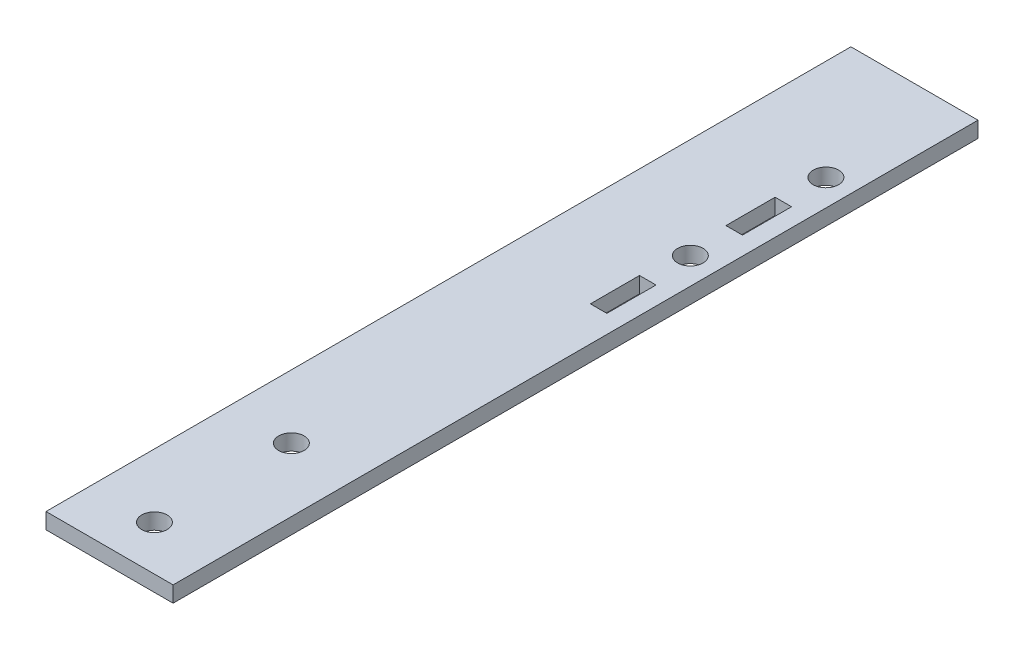
ISO-10303-21;
HEADER;
FILE_DESCRIPTION(('STEP AP214'),'2;1');
FILE_NAME('part.step','',(''),(''),'','','');
FILE_SCHEMA(('AUTOMOTIVE_DESIGN { 1 0 10303 214 1 1 1 1 }'));
ENDSEC;
DATA;
#1=APPLICATION_CONTEXT('core data for automotive mechanical design processes');
#2=APPLICATION_PROTOCOL_DEFINITION('international standard','automotive_design',2000,#1);
#3=PRODUCT_CONTEXT('',#1,'mechanical');
#4=PRODUCT('Part','Part','',(#3));
#5=PRODUCT_RELATED_PRODUCT_CATEGORY('part','',(#4));
#6=PRODUCT_DEFINITION_FORMATION('','',#4);
#7=PRODUCT_DEFINITION_CONTEXT('part definition',#1,'design');
#8=PRODUCT_DEFINITION('design','',#6,#7);
#9=PRODUCT_DEFINITION_SHAPE('','',#8);
#10=(LENGTH_UNIT() NAMED_UNIT(*) SI_UNIT(.MILLI.,.METRE.));
#11=(NAMED_UNIT(*) PLANE_ANGLE_UNIT() SI_UNIT($,.RADIAN.));
#12=(NAMED_UNIT(*) SI_UNIT($,.STERADIAN.) SOLID_ANGLE_UNIT());
#13=UNCERTAINTY_MEASURE_WITH_UNIT(LENGTH_MEASURE(1.E-05),#10,'distance_accuracy_value','');
#14=(GEOMETRIC_REPRESENTATION_CONTEXT(3) GLOBAL_UNCERTAINTY_ASSIGNED_CONTEXT((#13)) GLOBAL_UNIT_ASSIGNED_CONTEXT((#10,
#11,#12)) REPRESENTATION_CONTEXT('',''));
#15=CARTESIAN_POINT('',(0.,0.,0.));
#16=DIRECTION('',(0.,0.,1.));
#17=DIRECTION('',(1.,0.,0.));
#18=AXIS2_PLACEMENT_3D('',#15,#16,#17);
#19=CARTESIAN_POINT('',(19.05,0.,88.9));
#20=DIRECTION('',(0.,1.,0.));
#21=DIRECTION('',(-1.,0.,0.));
#22=AXIS2_PLACEMENT_3D('',#19,#20,#21);
#23=PLANE('',#22);
#24=CARTESIAN_POINT('',(9.525,0.,113.919));
#25=DIRECTION('',(0.,1.,0.));
#26=DIRECTION('',(-1.,0.,0.));
#27=AXIS2_PLACEMENT_3D('',#24,#25,#26);
#28=CIRCLE('',#27,1.905);
#29=CARTESIAN_POINT('',(7.62,0.,113.919));
#30=VERTEX_POINT('',#29);
#31=EDGE_CURVE('E170',#30,#30,#28,.T.);
#32=ORIENTED_EDGE('',*,*,#31,.T.);
#33=EDGE_LOOP('',(#32));
#34=FACE_BOUND('',#33,.T.);
#35=CARTESIAN_POINT('',(9.525,0.,93.3958));
#36=DIRECTION('',(0.,1.,0.));
#37=DIRECTION('',(-1.,0.,0.));
#38=AXIS2_PLACEMENT_3D('',#35,#36,#37);
#39=CIRCLE('',#38,1.905);
#40=CARTESIAN_POINT('',(7.62,0.,93.3958));
#41=VERTEX_POINT('',#40);
#42=EDGE_CURVE('E296',#41,#41,#39,.T.);
#43=ORIENTED_EDGE('',*,*,#42,.T.);
#44=EDGE_LOOP('',(#43));
#45=FACE_BOUND('',#44,.T.);
#46=CARTESIAN_POINT('',(15.08125,0.,18.82775));
#47=DIRECTION('',(0.,1.,0.));
#48=DIRECTION('',(0.,0.,1.));
#49=AXIS2_PLACEMENT_3D('',#46,#47,#48);
#50=CIRCLE('',#49,1.905);
#51=CARTESIAN_POINT('',(15.08125,0.,20.73275));
#52=VERTEX_POINT('',#51);
#53=EDGE_CURVE('E242',#52,#52,#50,.T.);
#54=ORIENTED_EDGE('',*,*,#53,.T.);
#55=EDGE_LOOP('',(#54));
#56=FACE_BOUND('',#55,.T.);
#57=DIRECTION('',(0.,0.,1.));
#58=VECTOR('',#57,1.);
#59=CARTESIAN_POINT('',(16.317595,0.,0.));
#60=LINE('',#59,#58);
#61=CARTESIAN_POINT('',(16.317595,0.,45.5295));
#62=VERTEX_POINT('',#61);
#63=CARTESIAN_POINT('',(16.317595,0.,52.8955));
#64=VERTEX_POINT('',#63);
#65=EDGE_CURVE('E178',#62,#64,#60,.T.);
#66=ORIENTED_EDGE('',*,*,#65,.F.);
#67=DIRECTION('',(1.,0.,0.));
#68=VECTOR('',#67,1.);
#69=CARTESIAN_POINT('',(0.,0.,45.5295));
#70=LINE('',#69,#68);
#71=CARTESIAN_POINT('',(13.844905,0.,45.5295));
#72=VERTEX_POINT('',#71);
#73=EDGE_CURVE('E181',#72,#62,#70,.T.);
#74=ORIENTED_EDGE('',*,*,#73,.F.);
#75=DIRECTION('',(0.,0.,-1.));
#76=VECTOR('',#75,1.);
#77=CARTESIAN_POINT('',(13.844905,0.,0.));
#78=LINE('',#77,#76);
#79=CARTESIAN_POINT('',(13.844905,0.,52.8955));
#80=VERTEX_POINT('',#79);
#81=EDGE_CURVE('E185',#80,#72,#78,.T.);
#82=ORIENTED_EDGE('',*,*,#81,.F.);
#83=DIRECTION('',(1.,0.,0.));
#84=VECTOR('',#83,1.);
#85=CARTESIAN_POINT('',(0.,0.,52.8955));
#86=LINE('',#85,#84);
#87=EDGE_CURVE('E189',#80,#64,#86,.T.);
#88=ORIENTED_EDGE('',*,*,#87,.T.);
#89=EDGE_LOOP('',(#66,#74,#82,#88));
#90=FACE_BOUND('',#89,.T.);
#91=CARTESIAN_POINT('',(15.08125,0.,39.14775));
#92=DIRECTION('',(0.,1.,0.));
#93=DIRECTION('',(0.,0.,1.));
#94=AXIS2_PLACEMENT_3D('',#91,#92,#93);
#95=CIRCLE('',#94,1.905);
#96=CARTESIAN_POINT('',(15.08125,0.,41.05275));
#97=VERTEX_POINT('',#96);
#98=EDGE_CURVE('E270',#97,#97,#95,.T.);
#99=ORIENTED_EDGE('',*,*,#98,.T.);
#100=EDGE_LOOP('',(#99));
#101=FACE_BOUND('',#100,.T.);
#102=DIRECTION('',(0.,0.,-1.));
#103=VECTOR('',#102,1.);
#104=CARTESIAN_POINT('',(0.,0.,88.9));
#105=LINE('',#104,#103);
#106=CARTESIAN_POINT('',(0.,0.,120.65));
#107=VERTEX_POINT('',#106);
#108=CARTESIAN_POINT('',(0.,0.,0.));
#109=VERTEX_POINT('',#108);
#110=EDGE_CURVE('E149',#107,#109,#105,.T.);
#111=ORIENTED_EDGE('',*,*,#110,.T.);
#112=DIRECTION('',(1.,0.,0.));
#113=VECTOR('',#112,1.);
#114=CARTESIAN_POINT('',(0.,0.,0.));
#115=LINE('',#114,#113);
#116=CARTESIAN_POINT('',(19.05,0.,0.));
#117=VERTEX_POINT('',#116);
#118=EDGE_CURVE('E62',#109,#117,#115,.T.);
#119=ORIENTED_EDGE('',*,*,#118,.T.);
#120=DIRECTION('',(0.,0.,-1.));
#121=VECTOR('',#120,1.);
#122=CARTESIAN_POINT('',(19.05,0.,88.9));
#123=LINE('',#122,#121);
#124=CARTESIAN_POINT('',(19.05,0.,120.65));
#125=VERTEX_POINT('',#124);
#126=EDGE_CURVE('E11',#125,#117,#123,.T.);
#127=ORIENTED_EDGE('',*,*,#126,.F.);
#128=DIRECTION('',(1.,0.,0.));
#129=VECTOR('',#128,1.);
#130=CARTESIAN_POINT('',(0.,0.,120.65));
#131=LINE('',#130,#129);
#132=EDGE_CURVE('E161',#107,#125,#131,.T.);
#133=ORIENTED_EDGE('',*,*,#132,.F.);
#134=EDGE_LOOP('',(#111,#119,#127,#133));
#135=FACE_BOUND('',#134,.T.);
#136=DIRECTION('',(0.,0.,1.));
#137=VECTOR('',#136,1.);
#138=CARTESIAN_POINT('',(16.317595,0.,0.));
#139=LINE('',#138,#137);
#140=CARTESIAN_POINT('',(16.317595,0.,25.2095));
#141=VERTEX_POINT('',#140);
#142=CARTESIAN_POINT('',(16.317595,0.,32.5755));
#143=VERTEX_POINT('',#142);
#144=EDGE_CURVE('E223',#141,#143,#139,.T.);
#145=ORIENTED_EDGE('',*,*,#144,.F.);
#146=DIRECTION('',(1.,0.,0.));
#147=VECTOR('',#146,1.);
#148=CARTESIAN_POINT('',(0.,0.,25.2095));
#149=LINE('',#148,#147);
#150=CARTESIAN_POINT('',(13.844905,0.,25.2095));
#151=VERTEX_POINT('',#150);
#152=EDGE_CURVE('E226',#151,#141,#149,.T.);
#153=ORIENTED_EDGE('',*,*,#152,.F.);
#154=DIRECTION('',(0.,0.,-1.));
#155=VECTOR('',#154,1.);
#156=CARTESIAN_POINT('',(13.844905,0.,0.));
#157=LINE('',#156,#155);
#158=CARTESIAN_POINT('',(13.844905,0.,32.5755));
#159=VERTEX_POINT('',#158);
#160=EDGE_CURVE('E230',#159,#151,#157,.T.);
#161=ORIENTED_EDGE('',*,*,#160,.F.);
#162=DIRECTION('',(-1.,0.,0.));
#163=VECTOR('',#162,1.);
#164=CARTESIAN_POINT('',(0.,0.,32.5755));
#165=LINE('',#164,#163);
#166=EDGE_CURVE('E233',#143,#159,#165,.T.);
#167=ORIENTED_EDGE('',*,*,#166,.F.);
#168=EDGE_LOOP('',(#145,#153,#161,#167));
#169=FACE_BOUND('',#168,.T.);
#170=ADVANCED_FACE('F47',(#34,#45,#56,#90,#101,#135,#169),#23,.F.);
#171=CARTESIAN_POINT('',(0.,2.38125,88.9));
#172=DIRECTION('',(0.,-1.,0.));
#173=DIRECTION('',(0.,0.,-1.));
#174=AXIS2_PLACEMENT_3D('',#171,#172,#173);
#175=PLANE('',#174);
#176=CARTESIAN_POINT('',(9.525,2.38125,113.919));
#177=DIRECTION('',(0.,1.,0.));
#178=DIRECTION('',(0.,0.,1.));
#179=AXIS2_PLACEMENT_3D('',#176,#177,#178);
#180=CIRCLE('',#179,1.905);
#181=CARTESIAN_POINT('',(9.525,2.38125,115.824));
#182=VERTEX_POINT('',#181);
#183=EDGE_CURVE('E292',#182,#182,#180,.T.);
#184=ORIENTED_EDGE('',*,*,#183,.F.);
#185=EDGE_LOOP('',(#184));
#186=FACE_BOUND('',#185,.T.);
#187=CARTESIAN_POINT('',(9.525,2.38125,93.3958));
#188=DIRECTION('',(0.,1.,0.));
#189=DIRECTION('',(0.,0.,1.));
#190=AXIS2_PLACEMENT_3D('',#187,#188,#189);
#191=CIRCLE('',#190,1.905);
#192=CARTESIAN_POINT('',(9.525,2.38125,95.3008));
#193=VERTEX_POINT('',#192);
#194=EDGE_CURVE('E141',#193,#193,#191,.T.);
#195=ORIENTED_EDGE('',*,*,#194,.F.);
#196=EDGE_LOOP('',(#195));
#197=FACE_BOUND('',#196,.T.);
#198=CARTESIAN_POINT('',(15.08125,2.38125,18.82775));
#199=DIRECTION('',(0.,1.,0.));
#200=DIRECTION('',(0.,0.,1.));
#201=AXIS2_PLACEMENT_3D('',#198,#199,#200);
#202=CIRCLE('',#201,1.905);
#203=CARTESIAN_POINT('',(15.08125,2.38125,20.73275));
#204=VERTEX_POINT('',#203);
#205=EDGE_CURVE('E176',#204,#204,#202,.T.);
#206=ORIENTED_EDGE('',*,*,#205,.F.);
#207=EDGE_LOOP('',(#206));
#208=FACE_BOUND('',#207,.T.);
#209=DIRECTION('',(0.,0.,1.));
#210=VECTOR('',#209,1.);
#211=CARTESIAN_POINT('',(16.317595,2.38125,0.));
#212=LINE('',#211,#210);
#213=CARTESIAN_POINT('',(16.317595,2.38125,45.5295));
#214=VERTEX_POINT('',#213);
#215=CARTESIAN_POINT('',(16.317595,2.38125,52.8955));
#216=VERTEX_POINT('',#215);
#217=EDGE_CURVE('E194',#214,#216,#212,.T.);
#218=ORIENTED_EDGE('',*,*,#217,.T.);
#219=DIRECTION('',(1.,0.,0.));
#220=VECTOR('',#219,1.);
#221=CARTESIAN_POINT('',(0.,2.38125,52.8955));
#222=LINE('',#221,#220);
#223=CARTESIAN_POINT('',(13.844905,2.38125,52.8955));
#224=VERTEX_POINT('',#223);
#225=EDGE_CURVE('E182',#224,#216,#222,.T.);
#226=ORIENTED_EDGE('',*,*,#225,.F.);
#227=DIRECTION('',(0.,0.,-1.));
#228=VECTOR('',#227,1.);
#229=CARTESIAN_POINT('',(13.844905,2.38125,0.));
#230=LINE('',#229,#228);
#231=CARTESIAN_POINT('',(13.844905,2.38125,45.5295));
#232=VERTEX_POINT('',#231);
#233=EDGE_CURVE('E203',#224,#232,#230,.T.);
#234=ORIENTED_EDGE('',*,*,#233,.T.);
#235=DIRECTION('',(1.,0.,0.));
#236=VECTOR('',#235,1.);
#237=CARTESIAN_POINT('',(0.,2.38125,45.5295));
#238=LINE('',#237,#236);
#239=EDGE_CURVE('E198',#232,#214,#238,.T.);
#240=ORIENTED_EDGE('',*,*,#239,.T.);
#241=EDGE_LOOP('',(#218,#226,#234,#240));
#242=FACE_BOUND('',#241,.T.);
#243=CARTESIAN_POINT('',(15.08125,2.38125,39.14775));
#244=DIRECTION('',(0.,1.,0.));
#245=DIRECTION('',(0.,0.,1.));
#246=AXIS2_PLACEMENT_3D('',#243,#244,#245);
#247=CIRCLE('',#246,1.905);
#248=CARTESIAN_POINT('',(15.08125,2.38125,41.05275));
#249=VERTEX_POINT('',#248);
#250=EDGE_CURVE('E213',#249,#249,#247,.T.);
#251=ORIENTED_EDGE('',*,*,#250,.F.);
#252=EDGE_LOOP('',(#251));
#253=FACE_BOUND('',#252,.T.);
#254=DIRECTION('',(0.,0.,-1.));
#255=VECTOR('',#254,1.);
#256=CARTESIAN_POINT('',(19.05,2.38125,88.9));
#257=LINE('',#256,#255);
#258=CARTESIAN_POINT('',(19.05,2.38125,120.65));
#259=VERTEX_POINT('',#258);
#260=CARTESIAN_POINT('',(19.05,2.38125,0.));
#261=VERTEX_POINT('',#260);
#262=EDGE_CURVE('E55',#259,#261,#257,.T.);
#263=ORIENTED_EDGE('',*,*,#262,.T.);
#264=DIRECTION('',(1.,0.,0.));
#265=VECTOR('',#264,1.);
#266=CARTESIAN_POINT('',(0.,2.38125,0.));
#267=LINE('',#266,#265);
#268=CARTESIAN_POINT('',(0.,2.38125,0.));
#269=VERTEX_POINT('',#268);
#270=EDGE_CURVE('E137',#269,#261,#267,.T.);
#271=ORIENTED_EDGE('',*,*,#270,.F.);
#272=DIRECTION('',(0.,0.,-1.));
#273=VECTOR('',#272,1.);
#274=CARTESIAN_POINT('',(0.,2.38125,88.9));
#275=LINE('',#274,#273);
#276=CARTESIAN_POINT('',(0.,2.38125,120.65));
#277=VERTEX_POINT('',#276);
#278=EDGE_CURVE('E279',#277,#269,#275,.T.);
#279=ORIENTED_EDGE('',*,*,#278,.F.);
#280=DIRECTION('',(1.,0.,0.));
#281=VECTOR('',#280,1.);
#282=CARTESIAN_POINT('',(0.,2.38125,120.65));
#283=LINE('',#282,#281);
#284=EDGE_CURVE('E167',#277,#259,#283,.T.);
#285=ORIENTED_EDGE('',*,*,#284,.T.);
#286=EDGE_LOOP('',(#263,#271,#279,#285));
#287=FACE_BOUND('',#286,.T.);
#288=DIRECTION('',(0.,0.,1.));
#289=VECTOR('',#288,1.);
#290=CARTESIAN_POINT('',(16.317595,2.38125,0.));
#291=LINE('',#290,#289);
#292=CARTESIAN_POINT('',(16.317595,2.38125,25.2095));
#293=VERTEX_POINT('',#292);
#294=CARTESIAN_POINT('',(16.317595,2.38125,32.5755));
#295=VERTEX_POINT('',#294);
#296=EDGE_CURVE('E237',#293,#295,#291,.T.);
#297=ORIENTED_EDGE('',*,*,#296,.T.);
#298=DIRECTION('',(-1.,0.,0.));
#299=VECTOR('',#298,1.);
#300=CARTESIAN_POINT('',(0.,2.38125,32.5755));
#301=LINE('',#300,#299);
#302=CARTESIAN_POINT('',(13.844905,2.38125,32.5755));
#303=VERTEX_POINT('',#302);
#304=EDGE_CURVE('E227',#295,#303,#301,.T.);
#305=ORIENTED_EDGE('',*,*,#304,.T.);
#306=DIRECTION('',(0.,0.,-1.));
#307=VECTOR('',#306,1.);
#308=CARTESIAN_POINT('',(13.844905,2.38125,0.));
#309=LINE('',#308,#307);
#310=CARTESIAN_POINT('',(13.844905,2.38125,25.2095));
#311=VERTEX_POINT('',#310);
#312=EDGE_CURVE('E246',#303,#311,#309,.T.);
#313=ORIENTED_EDGE('',*,*,#312,.T.);
#314=DIRECTION('',(1.,0.,0.));
#315=VECTOR('',#314,1.);
#316=CARTESIAN_POINT('',(0.,2.38125,25.2095));
#317=LINE('',#316,#315);
#318=EDGE_CURVE('E241',#311,#293,#317,.T.);
#319=ORIENTED_EDGE('',*,*,#318,.T.);
#320=EDGE_LOOP('',(#297,#305,#313,#319));
#321=FACE_BOUND('',#320,.T.);
#322=ADVANCED_FACE('F284',(#186,#197,#208,#242,#253,#287,#321),#175,.F.);
#323=CARTESIAN_POINT('',(19.05,2.38125,88.9));
#324=DIRECTION('',(-1.,0.,0.));
#325=DIRECTION('',(0.,0.,1.));
#326=AXIS2_PLACEMENT_3D('',#323,#324,#325);
#327=PLANE('',#326);
#328=ORIENTED_EDGE('',*,*,#126,.T.);
#329=DIRECTION('',(0.,1.,0.));
#330=VECTOR('',#329,1.);
#331=CARTESIAN_POINT('',(19.05,0.,0.));
#332=LINE('',#331,#330);
#333=EDGE_CURVE('E134',#117,#261,#332,.T.);
#334=ORIENTED_EDGE('',*,*,#333,.T.);
#335=ORIENTED_EDGE('',*,*,#262,.F.);
#336=DIRECTION('',(0.,1.,0.));
#337=VECTOR('',#336,1.);
#338=CARTESIAN_POINT('',(19.05,0.,120.65));
#339=LINE('',#338,#337);
#340=EDGE_CURVE('E154',#125,#259,#339,.T.);
#341=ORIENTED_EDGE('',*,*,#340,.F.);
#342=EDGE_LOOP('',(#328,#334,#335,#341));
#343=FACE_BOUND('',#342,.T.);
#344=ADVANCED_FACE('F152',(#343),#327,.F.);
#345=CARTESIAN_POINT('',(0.,0.,88.9));
#346=DIRECTION('',(1.,0.,0.));
#347=DIRECTION('',(0.,0.,-1.));
#348=AXIS2_PLACEMENT_3D('',#345,#346,#347);
#349=PLANE('',#348);
#350=ORIENTED_EDGE('',*,*,#278,.T.);
#351=DIRECTION('',(0.,1.,0.));
#352=VECTOR('',#351,1.);
#353=CARTESIAN_POINT('',(0.,0.,0.));
#354=LINE('',#353,#352);
#355=EDGE_CURVE('E142',#109,#269,#354,.T.);
#356=ORIENTED_EDGE('',*,*,#355,.F.);
#357=ORIENTED_EDGE('',*,*,#110,.F.);
#358=DIRECTION('',(0.,1.,0.));
#359=VECTOR('',#358,1.);
#360=CARTESIAN_POINT('',(0.,0.,120.65));
#361=LINE('',#360,#359);
#362=EDGE_CURVE('E160',#107,#277,#361,.T.);
#363=ORIENTED_EDGE('',*,*,#362,.T.);
#364=EDGE_LOOP('',(#350,#356,#357,#363));
#365=FACE_BOUND('',#364,.T.);
#366=ADVANCED_FACE('F287',(#365),#349,.F.);
#367=CARTESIAN_POINT('',(15.08125,0.,39.14775));
#368=DIRECTION('',(0.,1.,0.));
#369=DIRECTION('',(0.,0.,1.));
#370=AXIS2_PLACEMENT_3D('',#367,#368,#369);
#371=CYLINDRICAL_SURFACE('',#370,1.905);
#372=ORIENTED_EDGE('',*,*,#98,.F.);
#373=EDGE_LOOP('',(#372));
#374=FACE_BOUND('',#373,.T.);
#375=ORIENTED_EDGE('',*,*,#250,.T.);
#376=EDGE_LOOP('',(#375));
#377=FACE_BOUND('',#376,.T.);
#378=ADVANCED_FACE('F334',(#374,#377),#371,.F.);
#379=CARTESIAN_POINT('',(16.317595,0.,0.));
#380=DIRECTION('',(-1.,0.,0.));
#381=DIRECTION('',(0.,0.,1.));
#382=AXIS2_PLACEMENT_3D('',#379,#380,#381);
#383=PLANE('',#382);
#384=ORIENTED_EDGE('',*,*,#217,.F.);
#385=DIRECTION('',(0.,1.,0.));
#386=VECTOR('',#385,1.);
#387=CARTESIAN_POINT('',(16.317595,0.,45.5295));
#388=LINE('',#387,#386);
#389=EDGE_CURVE('E193',#62,#214,#388,.T.);
#390=ORIENTED_EDGE('',*,*,#389,.F.);
#391=ORIENTED_EDGE('',*,*,#65,.T.);
#392=DIRECTION('',(0.,1.,0.));
#393=VECTOR('',#392,1.);
#394=CARTESIAN_POINT('',(16.317595,0.,52.8955));
#395=LINE('',#394,#393);
#396=EDGE_CURVE('E210',#64,#216,#395,.T.);
#397=ORIENTED_EDGE('',*,*,#396,.T.);
#398=EDGE_LOOP('',(#384,#390,#391,#397));
#399=FACE_BOUND('',#398,.T.);
#400=ADVANCED_FACE('F337',(#399),#383,.T.);
#401=CARTESIAN_POINT('',(0.,0.,52.8955));
#402=DIRECTION('',(0.,0.,1.));
#403=DIRECTION('',(1.,0.,0.));
#404=AXIS2_PLACEMENT_3D('',#401,#402,#403);
#405=PLANE('',#404);
#406=ORIENTED_EDGE('',*,*,#225,.T.);
#407=ORIENTED_EDGE('',*,*,#396,.F.);
#408=ORIENTED_EDGE('',*,*,#87,.F.);
#409=DIRECTION('',(0.,1.,0.));
#410=VECTOR('',#409,1.);
#411=CARTESIAN_POINT('',(13.844905,0.,52.8955));
#412=LINE('',#411,#410);
#413=EDGE_CURVE('E214',#80,#224,#412,.T.);
#414=ORIENTED_EDGE('',*,*,#413,.T.);
#415=EDGE_LOOP('',(#406,#407,#408,#414));
#416=FACE_BOUND('',#415,.T.);
#417=ADVANCED_FACE('F361',(#416),#405,.F.);
#418=CARTESIAN_POINT('',(13.844905,0.,0.));
#419=DIRECTION('',(1.,0.,0.));
#420=DIRECTION('',(0.,0.,-1.));
#421=AXIS2_PLACEMENT_3D('',#418,#419,#420);
#422=PLANE('',#421);
#423=ORIENTED_EDGE('',*,*,#233,.F.);
#424=ORIENTED_EDGE('',*,*,#413,.F.);
#425=ORIENTED_EDGE('',*,*,#81,.T.);
#426=DIRECTION('',(0.,1.,0.));
#427=VECTOR('',#426,1.);
#428=CARTESIAN_POINT('',(13.844905,0.,45.5295));
#429=LINE('',#428,#427);
#430=EDGE_CURVE('E217',#72,#232,#429,.T.);
#431=ORIENTED_EDGE('',*,*,#430,.T.);
#432=EDGE_LOOP('',(#423,#424,#425,#431));
#433=FACE_BOUND('',#432,.T.);
#434=ADVANCED_FACE('F365',(#433),#422,.T.);
#435=CARTESIAN_POINT('',(0.,0.,45.5295));
#436=DIRECTION('',(0.,0.,1.));
#437=DIRECTION('',(1.,0.,0.));
#438=AXIS2_PLACEMENT_3D('',#435,#436,#437);
#439=PLANE('',#438);
#440=ORIENTED_EDGE('',*,*,#239,.F.);
#441=ORIENTED_EDGE('',*,*,#430,.F.);
#442=ORIENTED_EDGE('',*,*,#73,.T.);
#443=ORIENTED_EDGE('',*,*,#389,.T.);
#444=EDGE_LOOP('',(#440,#441,#442,#443));
#445=FACE_BOUND('',#444,.T.);
#446=ADVANCED_FACE('F348',(#445),#439,.T.);
#447=CARTESIAN_POINT('',(16.317595,0.,0.));
#448=DIRECTION('',(-1.,0.,0.));
#449=DIRECTION('',(0.,0.,1.));
#450=AXIS2_PLACEMENT_3D('',#447,#448,#449);
#451=PLANE('',#450);
#452=ORIENTED_EDGE('',*,*,#296,.F.);
#453=DIRECTION('',(0.,1.,0.));
#454=VECTOR('',#453,1.);
#455=CARTESIAN_POINT('',(16.317595,0.,25.2095));
#456=LINE('',#455,#454);
#457=EDGE_CURVE('E236',#141,#293,#456,.T.);
#458=ORIENTED_EDGE('',*,*,#457,.F.);
#459=ORIENTED_EDGE('',*,*,#144,.T.);
#460=DIRECTION('',(0.,1.,0.));
#461=VECTOR('',#460,1.);
#462=CARTESIAN_POINT('',(16.317595,0.,32.5755));
#463=LINE('',#462,#461);
#464=EDGE_CURVE('E199',#143,#295,#463,.T.);
#465=ORIENTED_EDGE('',*,*,#464,.T.);
#466=EDGE_LOOP('',(#452,#458,#459,#465));
#467=FACE_BOUND('',#466,.T.);
#468=ADVANCED_FACE('F344',(#467),#451,.T.);
#469=CARTESIAN_POINT('',(0.,0.,32.5755));
#470=DIRECTION('',(0.,0.,-1.));
#471=DIRECTION('',(-1.,0.,0.));
#472=AXIS2_PLACEMENT_3D('',#469,#470,#471);
#473=PLANE('',#472);
#474=ORIENTED_EDGE('',*,*,#304,.F.);
#475=ORIENTED_EDGE('',*,*,#464,.F.);
#476=ORIENTED_EDGE('',*,*,#166,.T.);
#477=DIRECTION('',(0.,1.,0.));
#478=VECTOR('',#477,1.);
#479=CARTESIAN_POINT('',(13.844905,0.,32.5755));
#480=LINE('',#479,#478);
#481=EDGE_CURVE('E256',#159,#303,#480,.T.);
#482=ORIENTED_EDGE('',*,*,#481,.T.);
#483=EDGE_LOOP('',(#474,#475,#476,#482));
#484=FACE_BOUND('',#483,.T.);
#485=ADVANCED_FACE('F347',(#484),#473,.T.);
#486=CARTESIAN_POINT('',(13.844905,0.,0.));
#487=DIRECTION('',(1.,0.,0.));
#488=DIRECTION('',(0.,0.,-1.));
#489=AXIS2_PLACEMENT_3D('',#486,#487,#488);
#490=PLANE('',#489);
#491=ORIENTED_EDGE('',*,*,#312,.F.);
#492=ORIENTED_EDGE('',*,*,#481,.F.);
#493=ORIENTED_EDGE('',*,*,#160,.T.);
#494=DIRECTION('',(0.,1.,0.));
#495=VECTOR('',#494,1.);
#496=CARTESIAN_POINT('',(13.844905,0.,25.2095));
#497=LINE('',#496,#495);
#498=EDGE_CURVE('E70',#151,#311,#497,.T.);
#499=ORIENTED_EDGE('',*,*,#498,.T.);
#500=EDGE_LOOP('',(#491,#492,#493,#499));
#501=FACE_BOUND('',#500,.T.);
#502=ADVANCED_FACE('F352',(#501),#490,.T.);
#503=CARTESIAN_POINT('',(0.,0.,25.2095));
#504=DIRECTION('',(0.,0.,1.));
#505=DIRECTION('',(1.,0.,0.));
#506=AXIS2_PLACEMENT_3D('',#503,#504,#505);
#507=PLANE('',#506);
#508=ORIENTED_EDGE('',*,*,#318,.F.);
#509=ORIENTED_EDGE('',*,*,#498,.F.);
#510=ORIENTED_EDGE('',*,*,#152,.T.);
#511=ORIENTED_EDGE('',*,*,#457,.T.);
#512=EDGE_LOOP('',(#508,#509,#510,#511));
#513=FACE_BOUND('',#512,.T.);
#514=ADVANCED_FACE('F342',(#513),#507,.T.);
#515=CARTESIAN_POINT('',(15.08125,0.,18.82775));
#516=DIRECTION('',(0.,1.,0.));
#517=DIRECTION('',(0.,0.,1.));
#518=AXIS2_PLACEMENT_3D('',#515,#516,#517);
#519=CYLINDRICAL_SURFACE('',#518,1.905);
#520=ORIENTED_EDGE('',*,*,#53,.F.);
#521=EDGE_LOOP('',(#520));
#522=FACE_BOUND('',#521,.T.);
#523=ORIENTED_EDGE('',*,*,#205,.T.);
#524=EDGE_LOOP('',(#523));
#525=FACE_BOUND('',#524,.T.);
#526=ADVANCED_FACE('F339',(#522,#525),#519,.F.);
#527=CARTESIAN_POINT('',(0.,0.,120.65));
#528=DIRECTION('',(0.,0.,1.));
#529=DIRECTION('',(1.,0.,0.));
#530=AXIS2_PLACEMENT_3D('',#527,#528,#529);
#531=PLANE('',#530);
#532=ORIENTED_EDGE('',*,*,#284,.F.);
#533=ORIENTED_EDGE('',*,*,#362,.F.);
#534=ORIENTED_EDGE('',*,*,#132,.T.);
#535=ORIENTED_EDGE('',*,*,#340,.T.);
#536=EDGE_LOOP('',(#532,#533,#534,#535));
#537=FACE_BOUND('',#536,.T.);
#538=ADVANCED_FACE('F164',(#537),#531,.T.);
#539=CARTESIAN_POINT('',(9.525,-0.15875,93.3958));
#540=DIRECTION('',(0.,1.,0.));
#541=DIRECTION('',(0.,0.,1.));
#542=AXIS2_PLACEMENT_3D('',#539,#540,#541);
#543=CYLINDRICAL_SURFACE('',#542,1.905);
#544=ORIENTED_EDGE('',*,*,#194,.T.);
#545=EDGE_LOOP('',(#544));
#546=FACE_BOUND('',#545,.T.);
#547=ORIENTED_EDGE('',*,*,#42,.F.);
#548=EDGE_LOOP('',(#547));
#549=FACE_BOUND('',#548,.T.);
#550=ADVANCED_FACE('F310',(#546,#549),#543,.F.);
#551=CARTESIAN_POINT('',(9.525,-0.15875,113.919));
#552=DIRECTION('',(0.,1.,0.));
#553=DIRECTION('',(0.,0.,1.));
#554=AXIS2_PLACEMENT_3D('',#551,#552,#553);
#555=CYLINDRICAL_SURFACE('',#554,1.905);
#556=ORIENTED_EDGE('',*,*,#183,.T.);
#557=EDGE_LOOP('',(#556));
#558=FACE_BOUND('',#557,.T.);
#559=ORIENTED_EDGE('',*,*,#31,.F.);
#560=EDGE_LOOP('',(#559));
#561=FACE_BOUND('',#560,.T.);
#562=ADVANCED_FACE('F308',(#558,#561),#555,.F.);
#563=CARTESIAN_POINT('',(0.,0.,0.));
#564=DIRECTION('',(0.,0.,1.));
#565=DIRECTION('',(1.,0.,0.));
#566=AXIS2_PLACEMENT_3D('',#563,#564,#565);
#567=PLANE('',#566);
#568=ORIENTED_EDGE('',*,*,#270,.T.);
#569=ORIENTED_EDGE('',*,*,#333,.F.);
#570=ORIENTED_EDGE('',*,*,#118,.F.);
#571=ORIENTED_EDGE('',*,*,#355,.T.);
#572=EDGE_LOOP('',(#568,#569,#570,#571));
#573=FACE_BOUND('',#572,.T.);
#574=ADVANCED_FACE('F135',(#573),#567,.F.);
#575=CLOSED_SHELL('',(#170,#322,#344,#366,#378,#400,#417,#434,#446,#468,#485,#502,#514,#526,
#538,#550,#562,#574));
#576=MANIFOLD_SOLID_BREP('B2',#575);
#577=ADVANCED_BREP_SHAPE_REPRESENTATION('',(#18,#576),#14);
#578=SHAPE_DEFINITION_REPRESENTATION(#9,#577);
ENDSEC;
END-ISO-10303-21;
